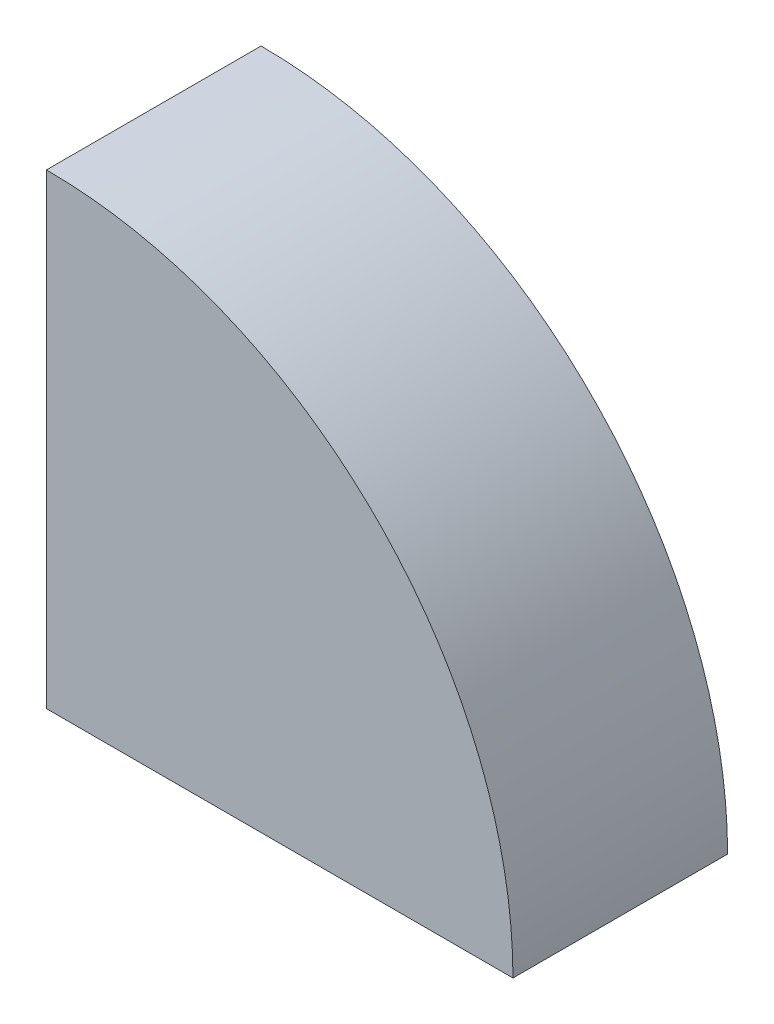
ISO-10303-21;
HEADER;
FILE_DESCRIPTION(('STEP AP214'),'2;1');
FILE_NAME('part.step','',(''),(''),'','','');
FILE_SCHEMA(('AUTOMOTIVE_DESIGN { 1 0 10303 214 1 1 1 1 }'));
ENDSEC;
DATA;
#1=APPLICATION_CONTEXT('core data for automotive mechanical design processes');
#2=APPLICATION_PROTOCOL_DEFINITION('international standard','automotive_design',2000,#1);
#3=PRODUCT_CONTEXT('',#1,'mechanical');
#4=PRODUCT('Part','Part','',(#3));
#5=PRODUCT_RELATED_PRODUCT_CATEGORY('part','',(#4));
#6=PRODUCT_DEFINITION_FORMATION('','',#4);
#7=PRODUCT_DEFINITION_CONTEXT('part definition',#1,'design');
#8=PRODUCT_DEFINITION('design','',#6,#7);
#9=PRODUCT_DEFINITION_SHAPE('','',#8);
#10=(LENGTH_UNIT() NAMED_UNIT(*) SI_UNIT(.MILLI.,.METRE.));
#11=(NAMED_UNIT(*) PLANE_ANGLE_UNIT() SI_UNIT($,.RADIAN.));
#12=(NAMED_UNIT(*) SI_UNIT($,.STERADIAN.) SOLID_ANGLE_UNIT());
#13=UNCERTAINTY_MEASURE_WITH_UNIT(LENGTH_MEASURE(1.E-05),#10,'distance_accuracy_value','');
#14=(GEOMETRIC_REPRESENTATION_CONTEXT(3) GLOBAL_UNCERTAINTY_ASSIGNED_CONTEXT((#13)) GLOBAL_UNIT_ASSIGNED_CONTEXT((#10,
#11,#12)) REPRESENTATION_CONTEXT('',''));
#15=CARTESIAN_POINT('',(0.,0.,0.));
#16=DIRECTION('',(0.,0.,1.));
#17=DIRECTION('',(1.,0.,0.));
#18=AXIS2_PLACEMENT_3D('',#15,#16,#17);
#19=CARTESIAN_POINT('',(1.8,1.8,144.004943915847));
#20=DIRECTION('',(0.,0.,-1.));
#21=DIRECTION('',(-1.,0.,0.));
#22=AXIS2_PLACEMENT_3D('',#19,#20,#21);
#23=CYLINDRICAL_SURFACE('',#22,74.9);
#24=DIRECTION('',(0.,0.,-1.));
#25=VECTOR('',#24,1.);
#26=CARTESIAN_POINT('',(1.8,76.7,144.004943915847));
#27=LINE('',#26,#25);
#28=CARTESIAN_POINT('',(1.79999999999994,76.7,29.5));
#29=VERTEX_POINT('',#28);
#30=CARTESIAN_POINT('',(1.79999999999994,76.7,7.3));
#31=VERTEX_POINT('',#30);
#32=EDGE_CURVE('E406',#29,#31,#27,.T.);
#33=ORIENTED_EDGE('',*,*,#32,.T.);
#34=CARTESIAN_POINT('',(1.8,1.8,7.3));
#35=DIRECTION('',(0.,0.,-1.));
#36=DIRECTION('',(-1.,0.,0.));
#37=AXIS2_PLACEMENT_3D('',#34,#35,#36);
#38=CIRCLE('',#37,74.9);
#39=CARTESIAN_POINT('',(3.49999999999995,76.6807051248852,7.3));
#40=VERTEX_POINT('',#39);
#41=EDGE_CURVE('E275',#31,#40,#38,.T.);
#42=ORIENTED_EDGE('',*,*,#41,.T.);
#43=DIRECTION('',(0.,0.,-1.));
#44=VECTOR('',#43,1.);
#45=CARTESIAN_POINT('',(3.49999999999995,76.6807051248852,7.3));
#46=LINE('',#45,#44);
#47=CARTESIAN_POINT('',(3.49999999999995,76.6807051248852,3.4));
#48=VERTEX_POINT('',#47);
#49=EDGE_CURVE('E258',#40,#48,#46,.T.);
#50=ORIENTED_EDGE('',*,*,#49,.T.);
#51=CARTESIAN_POINT('',(1.8,1.8,3.40000000000001));
#52=DIRECTION('',(0.,0.,-1.));
#53=DIRECTION('',(-1.,0.,0.));
#54=AXIS2_PLACEMENT_3D('',#51,#52,#53);
#55=CIRCLE('',#54,74.9);
#56=CARTESIAN_POINT('',(1.79999999999994,76.7,3.4));
#57=VERTEX_POINT('',#56);
#58=EDGE_CURVE('E269',#57,#48,#55,.T.);
#59=ORIENTED_EDGE('',*,*,#58,.F.);
#60=CARTESIAN_POINT('',(1.8,76.7,1.5));
#61=VERTEX_POINT('',#60);
#62=EDGE_CURVE('E398',#57,#61,#27,.T.);
#63=ORIENTED_EDGE('',*,*,#62,.T.);
#64=CARTESIAN_POINT('',(1.8,1.8,1.5));
#65=DIRECTION('',(0.,0.,1.));
#66=DIRECTION('',(1.,0.,0.));
#67=AXIS2_PLACEMENT_3D('',#64,#65,#66);
#68=CIRCLE('',#67,74.9);
#69=CARTESIAN_POINT('',(76.7,1.8,1.5));
#70=VERTEX_POINT('',#69);
#71=EDGE_CURVE('E383',#70,#61,#68,.T.);
#72=ORIENTED_EDGE('',*,*,#71,.F.);
#73=DIRECTION('',(0.,0.,-1.));
#74=VECTOR('',#73,1.);
#75=CARTESIAN_POINT('',(76.7,1.8,144.004943915847));
#76=LINE('',#75,#74);
#77=CARTESIAN_POINT('',(76.7,1.8,3.40000000000001));
#78=VERTEX_POINT('',#77);
#79=EDGE_CURVE('E402',#78,#70,#76,.T.);
#80=ORIENTED_EDGE('',*,*,#79,.F.);
#81=CARTESIAN_POINT('',(1.8,1.8,3.40000000000001));
#82=DIRECTION('',(0.,0.,-1.));
#83=DIRECTION('',(-1.,0.,0.));
#84=AXIS2_PLACEMENT_3D('',#81,#82,#83);
#85=CIRCLE('',#84,74.9);
#86=CARTESIAN_POINT('',(76.6807051248852,3.50000000000002,3.39999999999999));
#87=VERTEX_POINT('',#86);
#88=EDGE_CURVE('E334',#87,#78,#85,.T.);
#89=ORIENTED_EDGE('',*,*,#88,.F.);
#90=DIRECTION('',(0.,0.,-1.));
#91=VECTOR('',#90,1.);
#92=CARTESIAN_POINT('',(76.6807051248852,3.5,7.3));
#93=LINE('',#92,#91);
#94=CARTESIAN_POINT('',(76.6807051248852,3.5,7.3));
#95=VERTEX_POINT('',#94);
#96=EDGE_CURVE('E331',#95,#87,#93,.T.);
#97=ORIENTED_EDGE('',*,*,#96,.F.);
#98=CARTESIAN_POINT('',(1.8,1.8,7.3));
#99=DIRECTION('',(0.,0.,-1.));
#100=DIRECTION('',(-1.,0.,0.));
#101=AXIS2_PLACEMENT_3D('',#98,#99,#100);
#102=CIRCLE('',#101,74.9);
#103=CARTESIAN_POINT('',(76.7,1.8,7.3));
#104=VERTEX_POINT('',#103);
#105=EDGE_CURVE('E341',#95,#104,#102,.T.);
#106=ORIENTED_EDGE('',*,*,#105,.T.);
#107=CARTESIAN_POINT('',(76.7,1.8,29.5));
#108=VERTEX_POINT('',#107);
#109=EDGE_CURVE('E401',#108,#104,#76,.T.);
#110=ORIENTED_EDGE('',*,*,#109,.F.);
#111=CARTESIAN_POINT('',(1.8,1.8,29.5));
#112=DIRECTION('',(0.,0.,1.));
#113=DIRECTION('',(1.,0.,0.));
#114=AXIS2_PLACEMENT_3D('',#111,#112,#113);
#115=CIRCLE('',#114,74.9);
#116=CARTESIAN_POINT('',(76.6807051248852,3.49999999999951,29.5));
#117=VERTEX_POINT('',#116);
#118=EDGE_CURVE('E375',#108,#117,#115,.T.);
#119=ORIENTED_EDGE('',*,*,#118,.T.);
#120=DIRECTION('',(0.,0.,1.));
#121=VECTOR('',#120,1.);
#122=CARTESIAN_POINT('',(76.6807051248852,3.5,29.5));
#123=LINE('',#122,#121);
#124=CARTESIAN_POINT('',(76.6807051248852,3.5,33.4));
#125=VERTEX_POINT('',#124);
#126=EDGE_CURVE('E355',#117,#125,#123,.T.);
#127=ORIENTED_EDGE('',*,*,#126,.T.);
#128=CARTESIAN_POINT('',(1.8,1.8,33.4));
#129=DIRECTION('',(0.,0.,1.));
#130=DIRECTION('',(1.,0.,0.));
#131=AXIS2_PLACEMENT_3D('',#128,#129,#130);
#132=CIRCLE('',#131,74.9);
#133=CARTESIAN_POINT('',(76.7,1.79999999999999,33.4));
#134=VERTEX_POINT('',#133);
#135=EDGE_CURVE('E369',#134,#125,#132,.T.);
#136=ORIENTED_EDGE('',*,*,#135,.F.);
#137=CARTESIAN_POINT('',(76.7,1.8,34.9));
#138=VERTEX_POINT('',#137);
#139=EDGE_CURVE('E387',#138,#134,#76,.T.);
#140=ORIENTED_EDGE('',*,*,#139,.F.);
#141=CARTESIAN_POINT('',(1.8,1.8,34.9));
#142=DIRECTION('',(0.,0.,1.));
#143=DIRECTION('',(1.,0.,0.));
#144=AXIS2_PLACEMENT_3D('',#141,#142,#143);
#145=CIRCLE('',#144,74.9);
#146=CARTESIAN_POINT('',(1.8,76.7,34.9));
#147=VERTEX_POINT('',#146);
#148=EDGE_CURVE('E382',#138,#147,#145,.T.);
#149=ORIENTED_EDGE('',*,*,#148,.T.);
#150=CARTESIAN_POINT('',(1.8,76.7,33.4));
#151=VERTEX_POINT('',#150);
#152=EDGE_CURVE('E403',#147,#151,#27,.T.);
#153=ORIENTED_EDGE('',*,*,#152,.T.);
#154=CARTESIAN_POINT('',(1.8,1.8,33.4));
#155=DIRECTION('',(0.,0.,1.));
#156=DIRECTION('',(1.,0.,0.));
#157=AXIS2_PLACEMENT_3D('',#154,#155,#156);
#158=CIRCLE('',#157,74.9);
#159=CARTESIAN_POINT('',(3.49999999999995,76.6807051248852,33.4));
#160=VERTEX_POINT('',#159);
#161=EDGE_CURVE('E299',#160,#151,#158,.T.);
#162=ORIENTED_EDGE('',*,*,#161,.F.);
#163=DIRECTION('',(0.,0.,1.));
#164=VECTOR('',#163,1.);
#165=CARTESIAN_POINT('',(3.49999999999995,76.6807051248852,29.5));
#166=LINE('',#165,#164);
#167=CARTESIAN_POINT('',(3.49999999999995,76.6807051248852,29.5));
#168=VERTEX_POINT('',#167);
#169=EDGE_CURVE('E297',#168,#160,#166,.T.);
#170=ORIENTED_EDGE('',*,*,#169,.F.);
#171=CARTESIAN_POINT('',(1.8,1.8,29.5));
#172=DIRECTION('',(0.,0.,1.));
#173=DIRECTION('',(1.,0.,0.));
#174=AXIS2_PLACEMENT_3D('',#171,#172,#173);
#175=CIRCLE('',#174,74.9);
#176=EDGE_CURVE('E306',#168,#29,#175,.T.);
#177=ORIENTED_EDGE('',*,*,#176,.T.);
#178=EDGE_LOOP('',(#33,#42,#50,#59,#63,#72,#80,#89,#97,#106,#110,#119,#127,#136,#140,#149,#153,
#162,#170,#177));
#179=FACE_BOUND('',#178,.T.);
#180=ADVANCED_FACE('F18',(#179),#23,.F.);
#181=CARTESIAN_POINT('',(0.,75.7,36.8));
#182=DIRECTION('',(0.,1.,0.));
#183=DIRECTION('',(0.,0.,1.));
#184=AXIS2_PLACEMENT_3D('',#181,#182,#183);
#185=PLANE('',#184);
#186=DIRECTION('',(0.,0.,-1.));
#187=VECTOR('',#186,1.);
#188=CARTESIAN_POINT('',(1.8,75.7,144.004943915847));
#189=LINE('',#188,#187);
#190=CARTESIAN_POINT('',(1.79999999999998,75.7,34.9));
#191=VERTEX_POINT('',#190);
#192=CARTESIAN_POINT('',(1.79999999999995,75.7,33.4));
#193=VERTEX_POINT('',#192);
#194=EDGE_CURVE('E399',#191,#193,#189,.T.);
#195=ORIENTED_EDGE('',*,*,#194,.F.);
#196=DIRECTION('',(-1.,0.,0.));
#197=VECTOR('',#196,1.);
#198=CARTESIAN_POINT('',(0.,75.7,34.9));
#199=LINE('',#198,#197);
#200=CARTESIAN_POINT('',(0.,75.7,34.9));
#201=VERTEX_POINT('',#200);
#202=EDGE_CURVE('E33',#191,#201,#199,.T.);
#203=ORIENTED_EDGE('',*,*,#202,.T.);
#204=DIRECTION('',(0.,0.,-1.));
#205=VECTOR('',#204,1.);
#206=CARTESIAN_POINT('',(0.,75.7,36.8));
#207=LINE('',#206,#205);
#208=CARTESIAN_POINT('',(0.,75.7,0.));
#209=VERTEX_POINT('',#208);
#210=EDGE_CURVE('E26',#201,#209,#207,.T.);
#211=ORIENTED_EDGE('',*,*,#210,.T.);
#212=DIRECTION('',(1.,0.,0.));
#213=VECTOR('',#212,1.);
#214=CARTESIAN_POINT('',(0.,75.7,0.));
#215=LINE('',#214,#213);
#216=CARTESIAN_POINT('',(7.,75.7,0.));
#217=VERTEX_POINT('',#216);
#218=EDGE_CURVE('E432',#209,#217,#215,.T.);
#219=ORIENTED_EDGE('',*,*,#218,.T.);
#220=DIRECTION('',(0.,0.,-1.));
#221=VECTOR('',#220,1.);
#222=CARTESIAN_POINT('',(7.,75.7,36.8));
#223=LINE('',#222,#221);
#224=CARTESIAN_POINT('',(7.,75.7,1.5));
#225=VERTEX_POINT('',#224);
#226=EDGE_CURVE('E446',#225,#217,#223,.T.);
#227=ORIENTED_EDGE('',*,*,#226,.F.);
#228=DIRECTION('',(1.,0.,0.));
#229=VECTOR('',#228,1.);
#230=CARTESIAN_POINT('',(0.,75.7,1.5));
#231=LINE('',#230,#229);
#232=CARTESIAN_POINT('',(1.8,75.7,1.5));
#233=VERTEX_POINT('',#232);
#234=EDGE_CURVE('E417',#233,#225,#231,.T.);
#235=ORIENTED_EDGE('',*,*,#234,.F.);
#236=CARTESIAN_POINT('',(1.8,75.7,3.40000000000001));
#237=VERTEX_POINT('',#236);
#238=EDGE_CURVE('E381',#237,#233,#189,.T.);
#239=ORIENTED_EDGE('',*,*,#238,.F.);
#240=DIRECTION('',(1.,0.,0.));
#241=VECTOR('',#240,1.);
#242=CARTESIAN_POINT('',(1.79999999999995,75.7,3.4));
#243=LINE('',#242,#241);
#244=CARTESIAN_POINT('',(0.999999999999951,75.7,3.4));
#245=VERTEX_POINT('',#244);
#246=EDGE_CURVE('E231',#245,#237,#243,.T.);
#247=ORIENTED_EDGE('',*,*,#246,.F.);
#248=DIRECTION('',(0.,0.,-1.));
#249=VECTOR('',#248,1.);
#250=CARTESIAN_POINT('',(0.999999999999951,75.7,7.3));
#251=LINE('',#250,#249);
#252=CARTESIAN_POINT('',(0.999999999999951,75.7,7.3));
#253=VERTEX_POINT('',#252);
#254=EDGE_CURVE('E267',#253,#245,#251,.T.);
#255=ORIENTED_EDGE('',*,*,#254,.F.);
#256=DIRECTION('',(1.,0.,0.));
#257=VECTOR('',#256,1.);
#258=CARTESIAN_POINT('',(1.79999999999995,75.7,7.3));
#259=LINE('',#258,#257);
#260=CARTESIAN_POINT('',(1.79999999999995,75.7,7.3));
#261=VERTEX_POINT('',#260);
#262=EDGE_CURVE('E245',#253,#261,#259,.T.);
#263=ORIENTED_EDGE('',*,*,#262,.T.);
#264=CARTESIAN_POINT('',(1.79999999999995,75.7,29.5));
#265=VERTEX_POINT('',#264);
#266=EDGE_CURVE('E409',#265,#261,#189,.T.);
#267=ORIENTED_EDGE('',*,*,#266,.F.);
#268=DIRECTION('',(1.,0.,0.));
#269=VECTOR('',#268,1.);
#270=CARTESIAN_POINT('',(1.79999999999995,75.7,29.5));
#271=LINE('',#270,#269);
#272=CARTESIAN_POINT('',(0.999999999999951,75.7,29.5));
#273=VERTEX_POINT('',#272);
#274=EDGE_CURVE('E279',#273,#265,#271,.T.);
#275=ORIENTED_EDGE('',*,*,#274,.F.);
#276=DIRECTION('',(0.,0.,1.));
#277=VECTOR('',#276,1.);
#278=CARTESIAN_POINT('',(0.999999999999951,75.7,29.5));
#279=LINE('',#278,#277);
#280=CARTESIAN_POINT('',(0.999999999999951,75.7,33.4));
#281=VERTEX_POINT('',#280);
#282=EDGE_CURVE('E288',#273,#281,#279,.T.);
#283=ORIENTED_EDGE('',*,*,#282,.T.);
#284=DIRECTION('',(1.,0.,0.));
#285=VECTOR('',#284,1.);
#286=CARTESIAN_POINT('',(1.79999999999995,75.7,33.4));
#287=LINE('',#286,#285);
#288=EDGE_CURVE('E278',#281,#193,#287,.T.);
#289=ORIENTED_EDGE('',*,*,#288,.T.);
#290=EDGE_LOOP('',(#195,#203,#211,#219,#227,#235,#239,#247,#255,#263,#267,#275,#283,#289));
#291=FACE_BOUND('',#290,.T.);
#292=ADVANCED_FACE('F447',(#291),#185,.F.);
#293=CARTESIAN_POINT('',(1.8,0.,144.004943915847));
#294=DIRECTION('',(-1.,0.,0.));
#295=DIRECTION('',(0.,0.,1.));
#296=AXIS2_PLACEMENT_3D('',#293,#294,#295);
#297=PLANE('',#296);
#298=DIRECTION('',(0.,1.,0.));
#299=VECTOR('',#298,1.);
#300=CARTESIAN_POINT('',(1.79999999999995,75.7,7.3));
#301=LINE('',#300,#299);
#302=EDGE_CURVE('E248',#261,#31,#301,.T.);
#303=ORIENTED_EDGE('',*,*,#302,.T.);
#304=ORIENTED_EDGE('',*,*,#32,.F.);
#305=DIRECTION('',(0.,1.,0.));
#306=VECTOR('',#305,1.);
#307=CARTESIAN_POINT('',(1.79999999999995,75.7,29.5));
#308=LINE('',#307,#306);
#309=EDGE_CURVE('E286',#265,#29,#308,.T.);
#310=ORIENTED_EDGE('',*,*,#309,.F.);
#311=ORIENTED_EDGE('',*,*,#266,.T.);
#312=EDGE_LOOP('',(#303,#304,#310,#311));
#313=FACE_BOUND('',#312,.T.);
#314=ADVANCED_FACE('F477',(#313),#297,.F.);
#315=ORIENTED_EDGE('',*,*,#62,.F.);
#316=DIRECTION('',(0.,1.,0.));
#317=VECTOR('',#316,1.);
#318=CARTESIAN_POINT('',(1.79999999999995,75.7,3.4));
#319=LINE('',#318,#317);
#320=EDGE_CURVE('E260',#237,#57,#319,.T.);
#321=ORIENTED_EDGE('',*,*,#320,.F.);
#322=ORIENTED_EDGE('',*,*,#238,.T.);
#323=DIRECTION('',(0.,1.,0.));
#324=VECTOR('',#323,1.);
#325=CARTESIAN_POINT('',(1.8,0.,1.5));
#326=LINE('',#325,#324);
#327=EDGE_CURVE('E378',#233,#61,#326,.T.);
#328=ORIENTED_EDGE('',*,*,#327,.T.);
#329=EDGE_LOOP('',(#315,#321,#322,#328));
#330=FACE_BOUND('',#329,.T.);
#331=ADVANCED_FACE('F471',(#330),#297,.F.);
#332=CARTESIAN_POINT('',(75.7,0.,36.8));
#333=DIRECTION('',(1.,0.,0.));
#334=DIRECTION('',(0.,0.,-1.));
#335=AXIS2_PLACEMENT_3D('',#332,#333,#334);
#336=PLANE('',#335);
#337=DIRECTION('',(0.,0.,-1.));
#338=VECTOR('',#337,1.);
#339=CARTESIAN_POINT('',(75.7,0.,36.8));
#340=LINE('',#339,#338);
#341=CARTESIAN_POINT('',(75.7,0.,34.9));
#342=VERTEX_POINT('',#341);
#343=CARTESIAN_POINT('',(75.7,0.,0.));
#344=VERTEX_POINT('',#343);
#345=EDGE_CURVE('E41',#342,#344,#340,.T.);
#346=ORIENTED_EDGE('',*,*,#345,.F.);
#347=DIRECTION('',(0.,1.,0.));
#348=VECTOR('',#347,1.);
#349=CARTESIAN_POINT('',(75.7,7.,34.9));
#350=LINE('',#349,#348);
#351=CARTESIAN_POINT('',(75.7,1.8,34.9));
#352=VERTEX_POINT('',#351);
#353=EDGE_CURVE('E241',#342,#352,#350,.T.);
#354=ORIENTED_EDGE('',*,*,#353,.T.);
#355=DIRECTION('',(0.,0.,-1.));
#356=VECTOR('',#355,1.);
#357=CARTESIAN_POINT('',(75.7,1.8,144.004943915847));
#358=LINE('',#357,#356);
#359=CARTESIAN_POINT('',(75.7,1.8,33.4));
#360=VERTEX_POINT('',#359);
#361=EDGE_CURVE('E392',#352,#360,#358,.T.);
#362=ORIENTED_EDGE('',*,*,#361,.T.);
#363=DIRECTION('',(0.,1.,0.));
#364=VECTOR('',#363,1.);
#365=CARTESIAN_POINT('',(75.7,1.8,33.4));
#366=LINE('',#365,#364);
#367=CARTESIAN_POINT('',(75.7,1.,33.4));
#368=VERTEX_POINT('',#367);
#369=EDGE_CURVE('E343',#368,#360,#366,.T.);
#370=ORIENTED_EDGE('',*,*,#369,.F.);
#371=DIRECTION('',(0.,0.,1.));
#372=VECTOR('',#371,1.);
#373=CARTESIAN_POINT('',(75.7,1.,29.5));
#374=LINE('',#373,#372);
#375=CARTESIAN_POINT('',(75.7,1.,29.5));
#376=VERTEX_POINT('',#375);
#377=EDGE_CURVE('E366',#376,#368,#374,.T.);
#378=ORIENTED_EDGE('',*,*,#377,.F.);
#379=DIRECTION('',(0.,1.,0.));
#380=VECTOR('',#379,1.);
#381=CARTESIAN_POINT('',(75.7,1.8,29.5));
#382=LINE('',#381,#380);
#383=CARTESIAN_POINT('',(75.7,1.8,29.5));
#384=VERTEX_POINT('',#383);
#385=EDGE_CURVE('E344',#376,#384,#382,.T.);
#386=ORIENTED_EDGE('',*,*,#385,.T.);
#387=CARTESIAN_POINT('',(75.7,1.8,7.3));
#388=VERTEX_POINT('',#387);
#389=EDGE_CURVE('E412',#384,#388,#358,.T.);
#390=ORIENTED_EDGE('',*,*,#389,.T.);
#391=DIRECTION('',(0.,1.,0.));
#392=VECTOR('',#391,1.);
#393=CARTESIAN_POINT('',(75.7,1.8,7.3));
#394=LINE('',#393,#392);
#395=CARTESIAN_POINT('',(75.7,1.,7.3));
#396=VERTEX_POINT('',#395);
#397=EDGE_CURVE('E310',#396,#388,#394,.T.);
#398=ORIENTED_EDGE('',*,*,#397,.F.);
#399=DIRECTION('',(0.,0.,-1.));
#400=VECTOR('',#399,1.);
#401=CARTESIAN_POINT('',(75.7,1.,7.3));
#402=LINE('',#401,#400);
#403=CARTESIAN_POINT('',(75.7,1.,3.4));
#404=VERTEX_POINT('',#403);
#405=EDGE_CURVE('E322',#396,#404,#402,.T.);
#406=ORIENTED_EDGE('',*,*,#405,.T.);
#407=DIRECTION('',(0.,1.,0.));
#408=VECTOR('',#407,1.);
#409=CARTESIAN_POINT('',(75.7,1.8,3.4));
#410=LINE('',#409,#408);
#411=CARTESIAN_POINT('',(75.7,1.8,3.4));
#412=VERTEX_POINT('',#411);
#413=EDGE_CURVE('E309',#404,#412,#410,.T.);
#414=ORIENTED_EDGE('',*,*,#413,.T.);
#415=CARTESIAN_POINT('',(75.7,1.8,1.5));
#416=VERTEX_POINT('',#415);
#417=EDGE_CURVE('E386',#412,#416,#358,.T.);
#418=ORIENTED_EDGE('',*,*,#417,.T.);
#419=DIRECTION('',(0.,-1.,0.));
#420=VECTOR('',#419,1.);
#421=CARTESIAN_POINT('',(75.7,0.,1.5));
#422=LINE('',#421,#420);
#423=CARTESIAN_POINT('',(75.7,7.,1.5));
#424=VERTEX_POINT('',#423);
#425=EDGE_CURVE('E391',#424,#416,#422,.T.);
#426=ORIENTED_EDGE('',*,*,#425,.F.);
#427=DIRECTION('',(0.,0.,-1.));
#428=VECTOR('',#427,1.);
#429=CARTESIAN_POINT('',(75.7,7.,36.8));
#430=LINE('',#429,#428);
#431=CARTESIAN_POINT('',(75.7,7.,0.));
#432=VERTEX_POINT('',#431);
#433=EDGE_CURVE('E444',#424,#432,#430,.T.);
#434=ORIENTED_EDGE('',*,*,#433,.T.);
#435=DIRECTION('',(0.,-1.,0.));
#436=VECTOR('',#435,1.);
#437=CARTESIAN_POINT('',(75.7,0.,0.));
#438=LINE('',#437,#436);
#439=EDGE_CURVE('E438',#432,#344,#438,.T.);
#440=ORIENTED_EDGE('',*,*,#439,.T.);
#441=EDGE_LOOP('',(#346,#354,#362,#370,#378,#386,#390,#398,#406,#414,#418,#426,#434,#440));
#442=FACE_BOUND('',#441,.T.);
#443=ADVANCED_FACE('F530',(#442),#336,.F.);
#444=CARTESIAN_POINT('',(0.,1.8,144.004943915847));
#445=DIRECTION('',(0.,1.,0.));
#446=DIRECTION('',(0.,0.,1.));
#447=AXIS2_PLACEMENT_3D('',#444,#445,#446);
#448=PLANE('',#447);
#449=ORIENTED_EDGE('',*,*,#109,.T.);
#450=DIRECTION('',(1.,0.,0.));
#451=VECTOR('',#450,1.);
#452=CARTESIAN_POINT('',(75.7,1.8,7.3));
#453=LINE('',#452,#451);
#454=EDGE_CURVE('E319',#388,#104,#453,.T.);
#455=ORIENTED_EDGE('',*,*,#454,.F.);
#456=ORIENTED_EDGE('',*,*,#389,.F.);
#457=DIRECTION('',(1.,0.,0.));
#458=VECTOR('',#457,1.);
#459=CARTESIAN_POINT('',(75.7,1.8,29.5));
#460=LINE('',#459,#458);
#461=EDGE_CURVE('E346',#384,#108,#460,.T.);
#462=ORIENTED_EDGE('',*,*,#461,.T.);
#463=EDGE_LOOP('',(#449,#455,#456,#462));
#464=FACE_BOUND('',#463,.T.);
#465=ADVANCED_FACE('F533',(#464),#448,.T.);
#466=DIRECTION('',(1.,0.,0.));
#467=VECTOR('',#466,1.);
#468=CARTESIAN_POINT('',(75.7,1.8,3.4));
#469=LINE('',#468,#467);
#470=EDGE_CURVE('E314',#412,#78,#469,.T.);
#471=ORIENTED_EDGE('',*,*,#470,.T.);
#472=ORIENTED_EDGE('',*,*,#79,.T.);
#473=DIRECTION('',(1.,0.,0.));
#474=VECTOR('',#473,1.);
#475=CARTESIAN_POINT('',(0.,1.8,1.5));
#476=LINE('',#475,#474);
#477=EDGE_CURVE('E388',#416,#70,#476,.T.);
#478=ORIENTED_EDGE('',*,*,#477,.F.);
#479=ORIENTED_EDGE('',*,*,#417,.F.);
#480=EDGE_LOOP('',(#471,#472,#478,#479));
#481=FACE_BOUND('',#480,.T.);
#482=ADVANCED_FACE('F535',(#481),#448,.T.);
#483=CARTESIAN_POINT('',(7.,75.7,36.8));
#484=DIRECTION('',(0.707106781186547,0.707106781186548,0.));
#485=DIRECTION('',(-0.707106781186548,0.707106781186547,0.));
#486=AXIS2_PLACEMENT_3D('',#483,#484,#485);
#487=PLANE('',#486);
#488=DIRECTION('',(0.707106781186548,-0.707106781186547,0.));
#489=VECTOR('',#488,1.);
#490=CARTESIAN_POINT('',(7.,75.7,1.5));
#491=LINE('',#490,#489);
#492=EDGE_CURVE('E415',#225,#424,#491,.T.);
#493=ORIENTED_EDGE('',*,*,#492,.F.);
#494=ORIENTED_EDGE('',*,*,#226,.T.);
#495=DIRECTION('',(0.707106781186548,-0.707106781186547,0.));
#496=VECTOR('',#495,1.);
#497=CARTESIAN_POINT('',(7.,75.7,0.));
#498=LINE('',#497,#496);
#499=EDGE_CURVE('E435',#217,#432,#498,.T.);
#500=ORIENTED_EDGE('',*,*,#499,.T.);
#501=ORIENTED_EDGE('',*,*,#433,.F.);
#502=EDGE_LOOP('',(#493,#494,#500,#501));
#503=FACE_BOUND('',#502,.T.);
#504=ADVANCED_FACE('F460',(#503),#487,.F.);
#505=CARTESIAN_POINT('',(0.,0.,36.8));
#506=DIRECTION('',(0.,0.,-1.));
#507=DIRECTION('',(-1.,0.,0.));
#508=AXIS2_PLACEMENT_3D('',#505,#506,#507);
#509=CYLINDRICAL_SURFACE('',#508,80.);
#510=CARTESIAN_POINT('',(0.,0.,0.));
#511=DIRECTION('',(0.,0.,1.));
#512=DIRECTION('',(1.,0.,0.));
#513=AXIS2_PLACEMENT_3D('',#510,#511,#512);
#514=CIRCLE('',#513,80.);
#515=CARTESIAN_POINT('',(80.,0.,0.));
#516=VERTEX_POINT('',#515);
#517=CARTESIAN_POINT('',(0.,80.,0.));
#518=VERTEX_POINT('',#517);
#519=EDGE_CURVE('E419',#516,#518,#514,.T.);
#520=ORIENTED_EDGE('',*,*,#519,.T.);
#521=DIRECTION('',(0.,0.,-1.));
#522=VECTOR('',#521,1.);
#523=CARTESIAN_POINT('',(0.,80.,36.8));
#524=LINE('',#523,#522);
#525=CARTESIAN_POINT('',(0.,80.,36.8));
#526=VERTEX_POINT('',#525);
#527=EDGE_CURVE('E11',#526,#518,#524,.T.);
#528=ORIENTED_EDGE('',*,*,#527,.F.);
#529=CARTESIAN_POINT('',(0.,0.,36.8));
#530=DIRECTION('',(0.,0.,1.));
#531=DIRECTION('',(1.,0.,0.));
#532=AXIS2_PLACEMENT_3D('',#529,#530,#531);
#533=CIRCLE('',#532,80.);
#534=CARTESIAN_POINT('',(80.,0.,36.8));
#535=VERTEX_POINT('',#534);
#536=EDGE_CURVE('E420',#535,#526,#533,.T.);
#537=ORIENTED_EDGE('',*,*,#536,.F.);
#538=DIRECTION('',(0.,0.,-1.));
#539=VECTOR('',#538,1.);
#540=CARTESIAN_POINT('',(80.,0.,36.8));
#541=LINE('',#540,#539);
#542=EDGE_CURVE('E427',#535,#516,#541,.T.);
#543=ORIENTED_EDGE('',*,*,#542,.T.);
#544=EDGE_LOOP('',(#520,#528,#537,#543));
#545=FACE_BOUND('',#544,.T.);
#546=ADVANCED_FACE('F20',(#545),#509,.T.);
#547=CARTESIAN_POINT('',(0.,80.,36.8));
#548=DIRECTION('',(1.,0.,0.));
#549=DIRECTION('',(0.,1.,0.));
#550=AXIS2_PLACEMENT_3D('',#547,#548,#549);
#551=PLANE('',#550);
#552=DIRECTION('',(0.,-1.,0.));
#553=VECTOR('',#552,1.);
#554=CARTESIAN_POINT('',(0.,80.,0.));
#555=LINE('',#554,#553);
#556=EDGE_CURVE('E430',#518,#209,#555,.T.);
#557=ORIENTED_EDGE('',*,*,#556,.T.);
#558=ORIENTED_EDGE('',*,*,#210,.F.);
#559=DIRECTION('',(0.,-1.,0.));
#560=VECTOR('',#559,1.);
#561=CARTESIAN_POINT('',(0.,0.,34.9));
#562=LINE('',#561,#560);
#563=CARTESIAN_POINT('',(0.,0.,34.9));
#564=VERTEX_POINT('',#563);
#565=EDGE_CURVE('E234',#201,#564,#562,.T.);
#566=ORIENTED_EDGE('',*,*,#565,.T.);
#567=DIRECTION('',(0.,0.,1.));
#568=VECTOR('',#567,1.);
#569=CARTESIAN_POINT('',(0.,0.,34.9));
#570=LINE('',#569,#568);
#571=CARTESIAN_POINT('',(0.,0.,36.8));
#572=VERTEX_POINT('',#571);
#573=EDGE_CURVE('E222',#564,#572,#570,.T.);
#574=ORIENTED_EDGE('',*,*,#573,.T.);
#575=DIRECTION('',(0.,-1.,0.));
#576=VECTOR('',#575,1.);
#577=CARTESIAN_POINT('',(0.,80.,36.8));
#578=LINE('',#577,#576);
#579=EDGE_CURVE('E423',#526,#572,#578,.T.);
#580=ORIENTED_EDGE('',*,*,#579,.F.);
#581=ORIENTED_EDGE('',*,*,#527,.T.);
#582=EDGE_LOOP('',(#557,#558,#566,#574,#580,#581));
#583=FACE_BOUND('',#582,.T.);
#584=ADVANCED_FACE('F236',(#583),#551,.F.);
#585=CARTESIAN_POINT('',(80.,0.,36.8));
#586=DIRECTION('',(0.,1.,0.));
#587=DIRECTION('',(-1.,0.,0.));
#588=AXIS2_PLACEMENT_3D('',#585,#586,#587);
#589=PLANE('',#588);
#590=DIRECTION('',(1.,0.,0.));
#591=VECTOR('',#590,1.);
#592=CARTESIAN_POINT('',(80.,0.,0.));
#593=LINE('',#592,#591);
#594=EDGE_CURVE('E424',#344,#516,#593,.T.);
#595=ORIENTED_EDGE('',*,*,#594,.T.);
#596=ORIENTED_EDGE('',*,*,#542,.F.);
#597=DIRECTION('',(1.,0.,0.));
#598=VECTOR('',#597,1.);
#599=CARTESIAN_POINT('',(80.,0.,36.8));
#600=LINE('',#599,#598);
#601=EDGE_CURVE('E228',#572,#535,#600,.T.);
#602=ORIENTED_EDGE('',*,*,#601,.F.);
#603=ORIENTED_EDGE('',*,*,#573,.F.);
#604=DIRECTION('',(1.,0.,0.));
#605=VECTOR('',#604,1.);
#606=CARTESIAN_POINT('',(75.7,0.,34.9));
#607=LINE('',#606,#605);
#608=EDGE_CURVE('E226',#564,#342,#607,.T.);
#609=ORIENTED_EDGE('',*,*,#608,.T.);
#610=ORIENTED_EDGE('',*,*,#345,.T.);
#611=EDGE_LOOP('',(#595,#596,#602,#603,#609,#610));
#612=FACE_BOUND('',#611,.T.);
#613=ADVANCED_FACE('F224',(#612),#589,.F.);
#614=CARTESIAN_POINT('',(0.,0.,36.8));
#615=DIRECTION('',(0.,0.,1.));
#616=DIRECTION('',(1.,0.,0.));
#617=AXIS2_PLACEMENT_3D('',#614,#615,#616);
#618=PLANE('',#617);
#619=ORIENTED_EDGE('',*,*,#579,.T.);
#620=ORIENTED_EDGE('',*,*,#601,.T.);
#621=ORIENTED_EDGE('',*,*,#536,.T.);
#622=EDGE_LOOP('',(#619,#620,#621));
#623=FACE_BOUND('',#622,.T.);
#624=ADVANCED_FACE('F522',(#623),#618,.T.);
#625=CARTESIAN_POINT('',(0.,0.,0.));
#626=DIRECTION('',(0.,0.,1.));
#627=DIRECTION('',(1.,0.,0.));
#628=AXIS2_PLACEMENT_3D('',#625,#626,#627);
#629=PLANE('',#628);
#630=ORIENTED_EDGE('',*,*,#519,.F.);
#631=ORIENTED_EDGE('',*,*,#594,.F.);
#632=ORIENTED_EDGE('',*,*,#439,.F.);
#633=ORIENTED_EDGE('',*,*,#499,.F.);
#634=ORIENTED_EDGE('',*,*,#218,.F.);
#635=ORIENTED_EDGE('',*,*,#556,.F.);
#636=EDGE_LOOP('',(#630,#631,#632,#633,#634,#635));
#637=FACE_BOUND('',#636,.T.);
#638=ADVANCED_FACE('F454',(#637),#629,.F.);
#639=CARTESIAN_POINT('',(0.,0.,34.9));
#640=DIRECTION('',(0.,0.,1.));
#641=DIRECTION('',(1.,0.,0.));
#642=AXIS2_PLACEMENT_3D('',#639,#640,#641);
#643=PLANE('',#642);
#644=DIRECTION('',(1.,0.,0.));
#645=VECTOR('',#644,1.);
#646=CARTESIAN_POINT('',(0.,1.8,34.9));
#647=LINE('',#646,#645);
#648=EDGE_CURVE('E377',#352,#138,#647,.T.);
#649=ORIENTED_EDGE('',*,*,#648,.F.);
#650=ORIENTED_EDGE('',*,*,#353,.F.);
#651=ORIENTED_EDGE('',*,*,#608,.F.);
#652=ORIENTED_EDGE('',*,*,#565,.F.);
#653=ORIENTED_EDGE('',*,*,#202,.F.);
#654=DIRECTION('',(0.,1.,0.));
#655=VECTOR('',#654,1.);
#656=CARTESIAN_POINT('',(1.8,0.,34.9));
#657=LINE('',#656,#655);
#658=EDGE_CURVE('E395',#191,#147,#657,.T.);
#659=ORIENTED_EDGE('',*,*,#658,.T.);
#660=ORIENTED_EDGE('',*,*,#148,.F.);
#661=EDGE_LOOP('',(#649,#650,#651,#652,#653,#659,#660));
#662=FACE_BOUND('',#661,.T.);
#663=ADVANCED_FACE('F240',(#662),#643,.F.);
#664=CARTESIAN_POINT('',(0.,0.,1.5));
#665=DIRECTION('',(0.,0.,1.));
#666=DIRECTION('',(1.,0.,0.));
#667=AXIS2_PLACEMENT_3D('',#664,#665,#666);
#668=PLANE('',#667);
#669=ORIENTED_EDGE('',*,*,#234,.T.);
#670=ORIENTED_EDGE('',*,*,#492,.T.);
#671=ORIENTED_EDGE('',*,*,#425,.T.);
#672=ORIENTED_EDGE('',*,*,#477,.T.);
#673=ORIENTED_EDGE('',*,*,#71,.T.);
#674=ORIENTED_EDGE('',*,*,#327,.F.);
#675=EDGE_LOOP('',(#669,#670,#671,#672,#673,#674));
#676=FACE_BOUND('',#675,.T.);
#677=ADVANCED_FACE('F466',(#676),#668,.T.);
#678=ORIENTED_EDGE('',*,*,#194,.T.);
#679=DIRECTION('',(0.,1.,0.));
#680=VECTOR('',#679,1.);
#681=CARTESIAN_POINT('',(1.79999999999995,75.7,33.4));
#682=LINE('',#681,#680);
#683=EDGE_CURVE('E282',#193,#151,#682,.T.);
#684=ORIENTED_EDGE('',*,*,#683,.T.);
#685=ORIENTED_EDGE('',*,*,#152,.F.);
#686=ORIENTED_EDGE('',*,*,#658,.F.);
#687=EDGE_LOOP('',(#678,#684,#685,#686));
#688=FACE_BOUND('',#687,.T.);
#689=ADVANCED_FACE('F516',(#688),#297,.F.);
#690=DIRECTION('',(1.,0.,0.));
#691=VECTOR('',#690,1.);
#692=CARTESIAN_POINT('',(75.7,1.8,33.4));
#693=LINE('',#692,#691);
#694=EDGE_CURVE('E358',#360,#134,#693,.T.);
#695=ORIENTED_EDGE('',*,*,#694,.F.);
#696=ORIENTED_EDGE('',*,*,#361,.F.);
#697=ORIENTED_EDGE('',*,*,#648,.T.);
#698=ORIENTED_EDGE('',*,*,#139,.T.);
#699=EDGE_LOOP('',(#695,#696,#697,#698));
#700=FACE_BOUND('',#699,.T.);
#701=ADVANCED_FACE('F514',(#700),#448,.T.);
#702=CARTESIAN_POINT('',(75.7,1.,29.5));
#703=DIRECTION('',(0.,-1.,0.));
#704=DIRECTION('',(1.,0.,0.));
#705=AXIS2_PLACEMENT_3D('',#702,#703,#704);
#706=PLANE('',#705);
#707=DIRECTION('',(1.,0.,0.));
#708=VECTOR('',#707,1.);
#709=CARTESIAN_POINT('',(75.7,1.,33.4));
#710=LINE('',#709,#708);
#711=CARTESIAN_POINT('',(71.7,1.,33.4));
#712=VERTEX_POINT('',#711);
#713=EDGE_CURVE('E347',#712,#368,#710,.T.);
#714=ORIENTED_EDGE('',*,*,#713,.F.);
#715=DIRECTION('',(0.,0.,1.));
#716=VECTOR('',#715,1.);
#717=CARTESIAN_POINT('',(71.7,1.,29.5));
#718=LINE('',#717,#716);
#719=CARTESIAN_POINT('',(71.7,1.,29.5));
#720=VERTEX_POINT('',#719);
#721=EDGE_CURVE('E370',#720,#712,#718,.T.);
#722=ORIENTED_EDGE('',*,*,#721,.F.);
#723=DIRECTION('',(1.,0.,0.));
#724=VECTOR('',#723,1.);
#725=CARTESIAN_POINT('',(75.7,1.,29.5));
#726=LINE('',#725,#724);
#727=EDGE_CURVE('E352',#720,#376,#726,.T.);
#728=ORIENTED_EDGE('',*,*,#727,.T.);
#729=ORIENTED_EDGE('',*,*,#377,.T.);
#730=EDGE_LOOP('',(#714,#722,#728,#729));
#731=FACE_BOUND('',#730,.T.);
#732=ADVANCED_FACE('F574',(#731),#706,.T.);
#733=CARTESIAN_POINT('',(71.7,1.,29.5));
#734=DIRECTION('',(-0.448597962079624,0.893733667497207,0.));
#735=DIRECTION('',(-0.893733667497207,-0.448597962079625,0.));
#736=AXIS2_PLACEMENT_3D('',#733,#734,#735);
#737=PLANE('',#736);
#738=DIRECTION('',(-0.893733667497207,-0.448597962079624,0.));
#739=VECTOR('',#738,1.);
#740=CARTESIAN_POINT('',(71.7,1.,33.4));
#741=LINE('',#740,#739);
#742=EDGE_CURVE('E361',#125,#712,#741,.T.);
#743=ORIENTED_EDGE('',*,*,#742,.F.);
#744=ORIENTED_EDGE('',*,*,#126,.F.);
#745=DIRECTION('',(-0.893733667497207,-0.448597962079624,0.));
#746=VECTOR('',#745,1.);
#747=CARTESIAN_POINT('',(71.7,1.,29.5));
#748=LINE('',#747,#746);
#749=EDGE_CURVE('E349',#117,#720,#748,.T.);
#750=ORIENTED_EDGE('',*,*,#749,.T.);
#751=ORIENTED_EDGE('',*,*,#721,.T.);
#752=EDGE_LOOP('',(#743,#744,#750,#751));
#753=FACE_BOUND('',#752,.T.);
#754=ADVANCED_FACE('F569',(#753),#737,.T.);
#755=CARTESIAN_POINT('',(50.906020832769,2.35734972903286,29.5));
#756=DIRECTION('',(0.,0.,1.));
#757=DIRECTION('',(1.,0.,0.));
#758=AXIS2_PLACEMENT_3D('',#755,#756,#757);
#759=PLANE('',#758);
#760=ORIENTED_EDGE('',*,*,#118,.F.);
#761=ORIENTED_EDGE('',*,*,#461,.F.);
#762=ORIENTED_EDGE('',*,*,#385,.F.);
#763=ORIENTED_EDGE('',*,*,#727,.F.);
#764=ORIENTED_EDGE('',*,*,#749,.F.);
#765=EDGE_LOOP('',(#760,#761,#762,#763,#764));
#766=FACE_BOUND('',#765,.T.);
#767=ADVANCED_FACE('F562',(#766),#759,.F.);
#768=CARTESIAN_POINT('',(50.906020832769,2.35734972903286,33.4));
#769=DIRECTION('',(0.,0.,1.));
#770=DIRECTION('',(1.,0.,0.));
#771=AXIS2_PLACEMENT_3D('',#768,#769,#770);
#772=PLANE('',#771);
#773=ORIENTED_EDGE('',*,*,#694,.T.);
#774=ORIENTED_EDGE('',*,*,#135,.T.);
#775=ORIENTED_EDGE('',*,*,#742,.T.);
#776=ORIENTED_EDGE('',*,*,#713,.T.);
#777=ORIENTED_EDGE('',*,*,#369,.T.);
#778=EDGE_LOOP('',(#773,#774,#775,#776,#777));
#779=FACE_BOUND('',#778,.T.);
#780=ADVANCED_FACE('F572',(#779),#772,.T.);
#781=CARTESIAN_POINT('',(71.7,1.,7.3));
#782=DIRECTION('',(0.448597962079624,-0.893733667497207,0.));
#783=DIRECTION('',(0.893733667497207,0.448597962079625,0.));
#784=AXIS2_PLACEMENT_3D('',#781,#782,#783);
#785=PLANE('',#784);
#786=DIRECTION('',(-0.893733667497207,-0.448597962079624,0.));
#787=VECTOR('',#786,1.);
#788=CARTESIAN_POINT('',(71.7,1.,3.4));
#789=LINE('',#788,#787);
#790=CARTESIAN_POINT('',(71.7,1.,3.4));
#791=VERTEX_POINT('',#790);
#792=EDGE_CURVE('E328',#87,#791,#789,.T.);
#793=ORIENTED_EDGE('',*,*,#792,.T.);
#794=DIRECTION('',(0.,0.,-1.));
#795=VECTOR('',#794,1.);
#796=CARTESIAN_POINT('',(71.7,1.,7.3));
#797=LINE('',#796,#795);
#798=CARTESIAN_POINT('',(71.7,1.,7.3));
#799=VERTEX_POINT('',#798);
#800=EDGE_CURVE('E335',#799,#791,#797,.T.);
#801=ORIENTED_EDGE('',*,*,#800,.F.);
#802=DIRECTION('',(-0.893733667497207,-0.448597962079624,0.));
#803=VECTOR('',#802,1.);
#804=CARTESIAN_POINT('',(71.7,1.,7.3));
#805=LINE('',#804,#803);
#806=EDGE_CURVE('E317',#95,#799,#805,.T.);
#807=ORIENTED_EDGE('',*,*,#806,.F.);
#808=ORIENTED_EDGE('',*,*,#96,.T.);
#809=EDGE_LOOP('',(#793,#801,#807,#808));
#810=FACE_BOUND('',#809,.T.);
#811=ADVANCED_FACE('F613',(#810),#785,.F.);
#812=CARTESIAN_POINT('',(75.7,1.,7.3));
#813=DIRECTION('',(0.,1.,0.));
#814=DIRECTION('',(-1.,0.,0.));
#815=AXIS2_PLACEMENT_3D('',#812,#813,#814);
#816=PLANE('',#815);
#817=DIRECTION('',(1.,0.,0.));
#818=VECTOR('',#817,1.);
#819=CARTESIAN_POINT('',(75.7,1.,3.4));
#820=LINE('',#819,#818);
#821=EDGE_CURVE('E325',#791,#404,#820,.T.);
#822=ORIENTED_EDGE('',*,*,#821,.T.);
#823=ORIENTED_EDGE('',*,*,#405,.F.);
#824=DIRECTION('',(1.,0.,0.));
#825=VECTOR('',#824,1.);
#826=CARTESIAN_POINT('',(75.7,1.,7.3));
#827=LINE('',#826,#825);
#828=EDGE_CURVE('E313',#799,#396,#827,.T.);
#829=ORIENTED_EDGE('',*,*,#828,.F.);
#830=ORIENTED_EDGE('',*,*,#800,.T.);
#831=EDGE_LOOP('',(#822,#823,#829,#830));
#832=FACE_BOUND('',#831,.T.);
#833=ADVANCED_FACE('F609',(#832),#816,.F.);
#834=CARTESIAN_POINT('',(50.906020832769,2.35734972903286,7.3));
#835=DIRECTION('',(0.,0.,-1.));
#836=DIRECTION('',(1.,0.,0.));
#837=AXIS2_PLACEMENT_3D('',#834,#835,#836);
#838=PLANE('',#837);
#839=ORIENTED_EDGE('',*,*,#105,.F.);
#840=ORIENTED_EDGE('',*,*,#806,.T.);
#841=ORIENTED_EDGE('',*,*,#828,.T.);
#842=ORIENTED_EDGE('',*,*,#397,.T.);
#843=ORIENTED_EDGE('',*,*,#454,.T.);
#844=EDGE_LOOP('',(#839,#840,#841,#842,#843));
#845=FACE_BOUND('',#844,.T.);
#846=ADVANCED_FACE('F556',(#845),#838,.F.);
#847=CARTESIAN_POINT('',(50.906020832769,2.35734972903286,3.4));
#848=DIRECTION('',(0.,0.,-1.));
#849=DIRECTION('',(1.,0.,0.));
#850=AXIS2_PLACEMENT_3D('',#847,#848,#849);
#851=PLANE('',#850);
#852=ORIENTED_EDGE('',*,*,#792,.F.);
#853=ORIENTED_EDGE('',*,*,#88,.T.);
#854=ORIENTED_EDGE('',*,*,#470,.F.);
#855=ORIENTED_EDGE('',*,*,#413,.F.);
#856=ORIENTED_EDGE('',*,*,#821,.F.);
#857=EDGE_LOOP('',(#852,#853,#854,#855,#856));
#858=FACE_BOUND('',#857,.T.);
#859=ADVANCED_FACE('F603',(#858),#851,.T.);
#860=CARTESIAN_POINT('',(0.999999999999954,71.7,29.5));
#861=DIRECTION('',(-0.893733667497207,0.448597962079624,0.));
#862=DIRECTION('',(-0.448597962079624,-0.893733667497207,0.));
#863=AXIS2_PLACEMENT_3D('',#860,#861,#862);
#864=PLANE('',#863);
#865=DIRECTION('',(-0.448597962079624,-0.893733667497207,0.));
#866=VECTOR('',#865,1.);
#867=CARTESIAN_POINT('',(0.999999999999954,71.7,33.4));
#868=LINE('',#867,#866);
#869=CARTESIAN_POINT('',(0.999999999999954,71.7,33.4));
#870=VERTEX_POINT('',#869);
#871=EDGE_CURVE('E293',#160,#870,#868,.T.);
#872=ORIENTED_EDGE('',*,*,#871,.T.);
#873=DIRECTION('',(0.,0.,1.));
#874=VECTOR('',#873,1.);
#875=CARTESIAN_POINT('',(0.999999999999954,71.7,29.5));
#876=LINE('',#875,#874);
#877=CARTESIAN_POINT('',(0.999999999999954,71.7,29.5));
#878=VERTEX_POINT('',#877);
#879=EDGE_CURVE('E300',#878,#870,#876,.T.);
#880=ORIENTED_EDGE('',*,*,#879,.F.);
#881=DIRECTION('',(-0.448597962079624,-0.893733667497207,0.));
#882=VECTOR('',#881,1.);
#883=CARTESIAN_POINT('',(0.999999999999954,71.7,29.5));
#884=LINE('',#883,#882);
#885=EDGE_CURVE('E284',#168,#878,#884,.T.);
#886=ORIENTED_EDGE('',*,*,#885,.F.);
#887=ORIENTED_EDGE('',*,*,#169,.T.);
#888=EDGE_LOOP('',(#872,#880,#886,#887));
#889=FACE_BOUND('',#888,.T.);
#890=ADVANCED_FACE('F589',(#889),#864,.F.);
#891=CARTESIAN_POINT('',(0.999999999999951,75.7,29.5));
#892=DIRECTION('',(1.,0.,0.));
#893=DIRECTION('',(0.,1.,0.));
#894=AXIS2_PLACEMENT_3D('',#891,#892,#893);
#895=PLANE('',#894);
#896=DIRECTION('',(0.,1.,0.));
#897=VECTOR('',#896,1.);
#898=CARTESIAN_POINT('',(0.999999999999951,75.7,33.4));
#899=LINE('',#898,#897);
#900=EDGE_CURVE('E291',#870,#281,#899,.T.);
#901=ORIENTED_EDGE('',*,*,#900,.T.);
#902=ORIENTED_EDGE('',*,*,#282,.F.);
#903=DIRECTION('',(0.,1.,0.));
#904=VECTOR('',#903,1.);
#905=CARTESIAN_POINT('',(0.999999999999951,75.7,29.5));
#906=LINE('',#905,#904);
#907=EDGE_CURVE('E281',#878,#273,#906,.T.);
#908=ORIENTED_EDGE('',*,*,#907,.F.);
#909=ORIENTED_EDGE('',*,*,#879,.T.);
#910=EDGE_LOOP('',(#901,#902,#908,#909));
#911=FACE_BOUND('',#910,.T.);
#912=ADVANCED_FACE('F595',(#911),#895,.F.);
#913=CARTESIAN_POINT('',(2.35734972903283,50.906020832769,29.5));
#914=DIRECTION('',(0.,0.,1.));
#915=DIRECTION('',(0.,1.,0.));
#916=AXIS2_PLACEMENT_3D('',#913,#914,#915);
#917=PLANE('',#916);
#918=ORIENTED_EDGE('',*,*,#176,.F.);
#919=ORIENTED_EDGE('',*,*,#885,.T.);
#920=ORIENTED_EDGE('',*,*,#907,.T.);
#921=ORIENTED_EDGE('',*,*,#274,.T.);
#922=ORIENTED_EDGE('',*,*,#309,.T.);
#923=EDGE_LOOP('',(#918,#919,#920,#921,#922));
#924=FACE_BOUND('',#923,.T.);
#925=ADVANCED_FACE('F593',(#924),#917,.F.);
#926=CARTESIAN_POINT('',(2.35734972903283,50.906020832769,33.4));
#927=DIRECTION('',(0.,0.,1.));
#928=DIRECTION('',(0.,1.,0.));
#929=AXIS2_PLACEMENT_3D('',#926,#927,#928);
#930=PLANE('',#929);
#931=ORIENTED_EDGE('',*,*,#871,.F.);
#932=ORIENTED_EDGE('',*,*,#161,.T.);
#933=ORIENTED_EDGE('',*,*,#683,.F.);
#934=ORIENTED_EDGE('',*,*,#288,.F.);
#935=ORIENTED_EDGE('',*,*,#900,.F.);
#936=EDGE_LOOP('',(#931,#932,#933,#934,#935));
#937=FACE_BOUND('',#936,.T.);
#938=ADVANCED_FACE('F585',(#937),#930,.T.);
#939=CARTESIAN_POINT('',(0.999999999999951,75.7,7.3));
#940=DIRECTION('',(-1.,0.,0.));
#941=DIRECTION('',(0.,-1.,0.));
#942=AXIS2_PLACEMENT_3D('',#939,#940,#941);
#943=PLANE('',#942);
#944=DIRECTION('',(0.,1.,0.));
#945=VECTOR('',#944,1.);
#946=CARTESIAN_POINT('',(0.999999999999951,75.7,3.4));
#947=LINE('',#946,#945);
#948=CARTESIAN_POINT('',(0.999999999999954,71.7,3.4));
#949=VERTEX_POINT('',#948);
#950=EDGE_CURVE('E249',#949,#245,#947,.T.);
#951=ORIENTED_EDGE('',*,*,#950,.F.);
#952=DIRECTION('',(0.,0.,-1.));
#953=VECTOR('',#952,1.);
#954=CARTESIAN_POINT('',(0.999999999999954,71.7,7.3));
#955=LINE('',#954,#953);
#956=CARTESIAN_POINT('',(0.999999999999954,71.7,7.3));
#957=VERTEX_POINT('',#956);
#958=EDGE_CURVE('E270',#957,#949,#955,.T.);
#959=ORIENTED_EDGE('',*,*,#958,.F.);
#960=DIRECTION('',(0.,1.,0.));
#961=VECTOR('',#960,1.);
#962=CARTESIAN_POINT('',(0.999999999999951,75.7,7.3));
#963=LINE('',#962,#961);
#964=EDGE_CURVE('E255',#957,#253,#963,.T.);
#965=ORIENTED_EDGE('',*,*,#964,.T.);
#966=ORIENTED_EDGE('',*,*,#254,.T.);
#967=EDGE_LOOP('',(#951,#959,#965,#966));
#968=FACE_BOUND('',#967,.T.);
#969=ADVANCED_FACE('F488',(#968),#943,.T.);
#970=CARTESIAN_POINT('',(0.999999999999954,71.7,7.3));
#971=DIRECTION('',(0.893733667497207,-0.448597962079624,0.));
#972=DIRECTION('',(0.448597962079624,0.893733667497207,0.));
#973=AXIS2_PLACEMENT_3D('',#970,#971,#972);
#974=PLANE('',#973);
#975=DIRECTION('',(-0.448597962079624,-0.893733667497207,0.));
#976=VECTOR('',#975,1.);
#977=CARTESIAN_POINT('',(0.999999999999954,71.7,3.4));
#978=LINE('',#977,#976);
#979=EDGE_CURVE('E262',#48,#949,#978,.T.);
#980=ORIENTED_EDGE('',*,*,#979,.F.);
#981=ORIENTED_EDGE('',*,*,#49,.F.);
#982=DIRECTION('',(-0.448597962079624,-0.893733667497207,0.));
#983=VECTOR('',#982,1.);
#984=CARTESIAN_POINT('',(0.999999999999954,71.7,7.3));
#985=LINE('',#984,#983);
#986=EDGE_CURVE('E252',#40,#957,#985,.T.);
#987=ORIENTED_EDGE('',*,*,#986,.T.);
#988=ORIENTED_EDGE('',*,*,#958,.T.);
#989=EDGE_LOOP('',(#980,#981,#987,#988));
#990=FACE_BOUND('',#989,.T.);
#991=ADVANCED_FACE('F491',(#990),#974,.T.);
#992=CARTESIAN_POINT('',(2.35734972903283,50.906020832769,7.3));
#993=DIRECTION('',(0.,0.,-1.));
#994=DIRECTION('',(0.,1.,0.));
#995=AXIS2_PLACEMENT_3D('',#992,#993,#994);
#996=PLANE('',#995);
#997=ORIENTED_EDGE('',*,*,#41,.F.);
#998=ORIENTED_EDGE('',*,*,#302,.F.);
#999=ORIENTED_EDGE('',*,*,#262,.F.);
#1000=ORIENTED_EDGE('',*,*,#964,.F.);
#1001=ORIENTED_EDGE('',*,*,#986,.F.);
#1002=EDGE_LOOP('',(#997,#998,#999,#1000,#1001));
#1003=FACE_BOUND('',#1002,.T.);
#1004=ADVANCED_FACE('F484',(#1003),#996,.F.);
#1005=CARTESIAN_POINT('',(2.35734972903283,50.906020832769,3.4));
#1006=DIRECTION('',(0.,0.,-1.));
#1007=DIRECTION('',(0.,1.,0.));
#1008=AXIS2_PLACEMENT_3D('',#1005,#1006,#1007);
#1009=PLANE('',#1008);
#1010=ORIENTED_EDGE('',*,*,#320,.T.);
#1011=ORIENTED_EDGE('',*,*,#58,.T.);
#1012=ORIENTED_EDGE('',*,*,#979,.T.);
#1013=ORIENTED_EDGE('',*,*,#950,.T.);
#1014=ORIENTED_EDGE('',*,*,#246,.T.);
#1015=EDGE_LOOP('',(#1010,#1011,#1012,#1013,#1014));
#1016=FACE_BOUND('',#1015,.T.);
#1017=ADVANCED_FACE('F497',(#1016),#1009,.T.);
#1018=CLOSED_SHELL('',(#180,#292,#314,#331,#443,#465,#482,#504,#546,#584,#613,#624,#638,#663,
#677,#689,#701,#732,#754,#767,#780,#811,#833,#846,#859,#890,#912,#925,#938,#969,#991,#1004,#1017));
#1019=MANIFOLD_SOLID_BREP('B1',#1018);
#1020=ADVANCED_BREP_SHAPE_REPRESENTATION('',(#18,#1019),#14);
#1021=SHAPE_DEFINITION_REPRESENTATION(#9,#1020);
ENDSEC;
END-ISO-10303-21;
